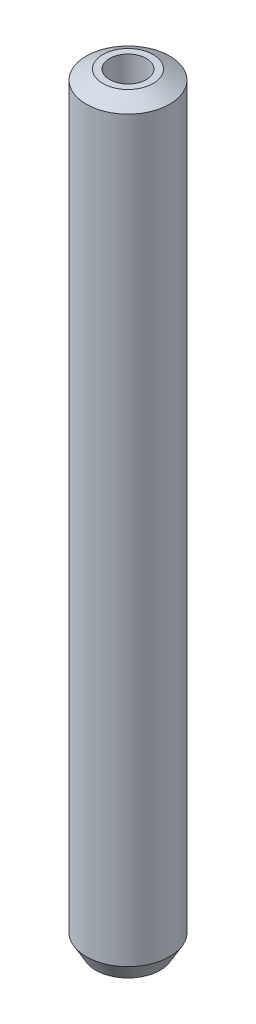
ISO-10303-21;
HEADER;
FILE_DESCRIPTION(('STEP AP214'),'2;1');
FILE_NAME('part.step','',(''),(''),'','','');
FILE_SCHEMA(('AUTOMOTIVE_DESIGN { 1 0 10303 214 1 1 1 1 }'));
ENDSEC;
DATA;
#1=APPLICATION_CONTEXT('core data for automotive mechanical design processes');
#2=APPLICATION_PROTOCOL_DEFINITION('international standard','automotive_design',2000,#1);
#3=PRODUCT_CONTEXT('',#1,'mechanical');
#4=PRODUCT('Part','Part','',(#3));
#5=PRODUCT_RELATED_PRODUCT_CATEGORY('part','',(#4));
#6=PRODUCT_DEFINITION_FORMATION('','',#4);
#7=PRODUCT_DEFINITION_CONTEXT('part definition',#1,'design');
#8=PRODUCT_DEFINITION('design','',#6,#7);
#9=PRODUCT_DEFINITION_SHAPE('','',#8);
#10=(LENGTH_UNIT() NAMED_UNIT(*) SI_UNIT(.MILLI.,.METRE.));
#11=(NAMED_UNIT(*) PLANE_ANGLE_UNIT() SI_UNIT($,.RADIAN.));
#12=(NAMED_UNIT(*) SI_UNIT($,.STERADIAN.) SOLID_ANGLE_UNIT());
#13=UNCERTAINTY_MEASURE_WITH_UNIT(LENGTH_MEASURE(1.E-05),#10,'distance_accuracy_value','');
#14=(GEOMETRIC_REPRESENTATION_CONTEXT(3) GLOBAL_UNCERTAINTY_ASSIGNED_CONTEXT((#13)) GLOBAL_UNIT_ASSIGNED_CONTEXT((#10,
#11,#12)) REPRESENTATION_CONTEXT('',''));
#15=CARTESIAN_POINT('',(0.,0.,0.));
#16=DIRECTION('',(0.,0.,1.));
#17=DIRECTION('',(1.,0.,0.));
#18=AXIS2_PLACEMENT_3D('',#15,#16,#17);
#19=CARTESIAN_POINT('',(0.,320.467732865811,0.));
#20=DIRECTION('',(0.,-1.,0.));
#21=DIRECTION('',(0.,0.,-1.));
#22=AXIS2_PLACEMENT_3D('',#19,#20,#21);
#23=CYLINDRICAL_SURFACE('',#22,17.5);
#24=CARTESIAN_POINT('',(0.,316.447376239842,0.));
#25=DIRECTION('',(0.,1.,0.));
#26=DIRECTION('',(0.,0.,1.));
#27=AXIS2_PLACEMENT_3D('',#24,#25,#26);
#28=CIRCLE('',#27,17.5);
#29=CARTESIAN_POINT('',(0.,316.447376239842,17.5));
#30=VERTEX_POINT('',#29);
#31=EDGE_CURVE('E50',#30,#30,#28,.F.);
#32=ORIENTED_EDGE('',*,*,#31,.T.);
#33=EDGE_LOOP('',(#32));
#34=FACE_BOUND('',#33,.T.);
#35=CARTESIAN_POINT('',(0.,6.96346194072323,0.));
#36=DIRECTION('',(0.,1.,0.));
#37=DIRECTION('',(0.,0.,1.));
#38=AXIS2_PLACEMENT_3D('',#35,#36,#37);
#39=CIRCLE('',#38,17.5);
#40=CARTESIAN_POINT('',(0.,6.96346194072323,17.5));
#41=VERTEX_POINT('',#40);
#42=EDGE_CURVE('E51',#41,#41,#39,.T.);
#43=ORIENTED_EDGE('',*,*,#42,.T.);
#44=EDGE_LOOP('',(#43));
#45=FACE_BOUND('',#44,.T.);
#46=ADVANCED_FACE('F39',(#34,#45),#23,.T.);
#47=CARTESIAN_POINT('',(0.,320.467732865811,0.));
#48=DIRECTION('',(0.,1.,0.));
#49=DIRECTION('',(0.,0.,1.));
#50=AXIS2_PLACEMENT_3D('',#47,#48,#49);
#51=PLANE('',#50);
#52=CARTESIAN_POINT('',(0.,320.467732865811,0.));
#53=DIRECTION('',(0.,1.,0.));
#54=DIRECTION('',(0.,0.,1.));
#55=AXIS2_PLACEMENT_3D('',#52,#53,#54);
#56=CIRCLE('',#55,10.5365380592765);
#57=CARTESIAN_POINT('',(0.,320.467732865811,10.5365380592765));
#58=VERTEX_POINT('',#57);
#59=EDGE_CURVE('E54',#58,#58,#56,.T.);
#60=ORIENTED_EDGE('',*,*,#59,.T.);
#61=EDGE_LOOP('',(#60));
#62=FACE_BOUND('',#61,.T.);
#63=CARTESIAN_POINT('',(0.,320.467732865811,0.));
#64=DIRECTION('',(0.,1.,0.));
#65=DIRECTION('',(0.,0.,1.));
#66=AXIS2_PLACEMENT_3D('',#63,#64,#65);
#67=CIRCLE('',#66,7.70654568243775);
#68=CARTESIAN_POINT('',(0.,320.467732865811,7.70654568243775));
#69=VERTEX_POINT('',#68);
#70=EDGE_CURVE('E58',#69,#69,#67,.T.);
#71=ORIENTED_EDGE('',*,*,#70,.F.);
#72=EDGE_LOOP('',(#71));
#73=FACE_BOUND('',#72,.T.);
#74=ADVANCED_FACE('F69',(#62,#73),#51,.T.);
#75=CARTESIAN_POINT('',(0.,0.,0.));
#76=DIRECTION('',(0.,1.,0.));
#77=DIRECTION('',(0.,0.,1.));
#78=AXIS2_PLACEMENT_3D('',#75,#76,#77);
#79=PLANE('',#78);
#80=CARTESIAN_POINT('',(0.,0.,0.));
#81=DIRECTION('',(0.,1.,0.));
#82=DIRECTION('',(0.,0.,1.));
#83=AXIS2_PLACEMENT_3D('',#80,#81,#82);
#84=CIRCLE('',#83,13.4796433740317);
#85=CARTESIAN_POINT('',(0.,0.,13.4796433740317));
#86=VERTEX_POINT('',#85);
#87=EDGE_CURVE('E10',#86,#86,#84,.F.);
#88=ORIENTED_EDGE('',*,*,#87,.T.);
#89=EDGE_LOOP('',(#88));
#90=FACE_BOUND('',#89,.T.);
#91=CARTESIAN_POINT('',(0.,0.,0.));
#92=DIRECTION('',(0.,1.,0.));
#93=DIRECTION('',(0.,0.,1.));
#94=AXIS2_PLACEMENT_3D('',#91,#92,#93);
#95=CIRCLE('',#94,7.70654568243775);
#96=CARTESIAN_POINT('',(0.,0.,7.70654568243775));
#97=VERTEX_POINT('',#96);
#98=EDGE_CURVE('E63',#97,#97,#95,.T.);
#99=ORIENTED_EDGE('',*,*,#98,.T.);
#100=EDGE_LOOP('',(#99));
#101=FACE_BOUND('',#100,.T.);
#102=ADVANCED_FACE('F75',(#90,#101),#79,.F.);
#103=CARTESIAN_POINT('',(0.,320.467732865811,0.));
#104=DIRECTION('',(0.,-1.,0.));
#105=DIRECTION('',(0.,0.,-1.));
#106=AXIS2_PLACEMENT_3D('',#103,#104,#105);
#107=CYLINDRICAL_SURFACE('',#106,7.70654568243775);
#108=ORIENTED_EDGE('',*,*,#70,.T.);
#109=EDGE_LOOP('',(#108));
#110=FACE_BOUND('',#109,.T.);
#111=ORIENTED_EDGE('',*,*,#98,.F.);
#112=EDGE_LOOP('',(#111));
#113=FACE_BOUND('',#112,.T.);
#114=ADVANCED_FACE('F70',(#110,#113),#107,.F.);
#115=CARTESIAN_POINT('',(0.,320.467732865811,0.));
#116=DIRECTION('',(0.,-1.,0.));
#117=DIRECTION('',(0.,0.,-1.));
#118=AXIS2_PLACEMENT_3D('',#115,#116,#117);
#119=CONICAL_SURFACE('',#118,10.5365380592765,1.0471975511966);
#120=ORIENTED_EDGE('',*,*,#31,.F.);
#121=EDGE_LOOP('',(#120));
#122=FACE_BOUND('',#121,.T.);
#123=ORIENTED_EDGE('',*,*,#59,.F.);
#124=EDGE_LOOP('',(#123));
#125=FACE_BOUND('',#124,.T.);
#126=ADVANCED_FACE('F81',(#122,#125),#119,.T.);
#127=CARTESIAN_POINT('',(0.,6.96346194072323,0.));
#128=DIRECTION('',(0.,1.,0.));
#129=DIRECTION('',(0.,0.,1.));
#130=AXIS2_PLACEMENT_3D('',#127,#128,#129);
#131=CONICAL_SURFACE('',#130,17.5,0.523598775598305);
#132=ORIENTED_EDGE('',*,*,#87,.F.);
#133=EDGE_LOOP('',(#132));
#134=FACE_BOUND('',#133,.T.);
#135=ORIENTED_EDGE('',*,*,#42,.F.);
#136=EDGE_LOOP('',(#135));
#137=FACE_BOUND('',#136,.T.);
#138=ADVANCED_FACE('F45',(#134,#137),#131,.T.);
#139=CLOSED_SHELL('',(#46,#74,#102,#114,#126,#138));
#140=MANIFOLD_SOLID_BREP('B2',#139);
#141=ADVANCED_BREP_SHAPE_REPRESENTATION('',(#18,#140),#14);
#142=SHAPE_DEFINITION_REPRESENTATION(#9,#141);
ENDSEC;
END-ISO-10303-21;
